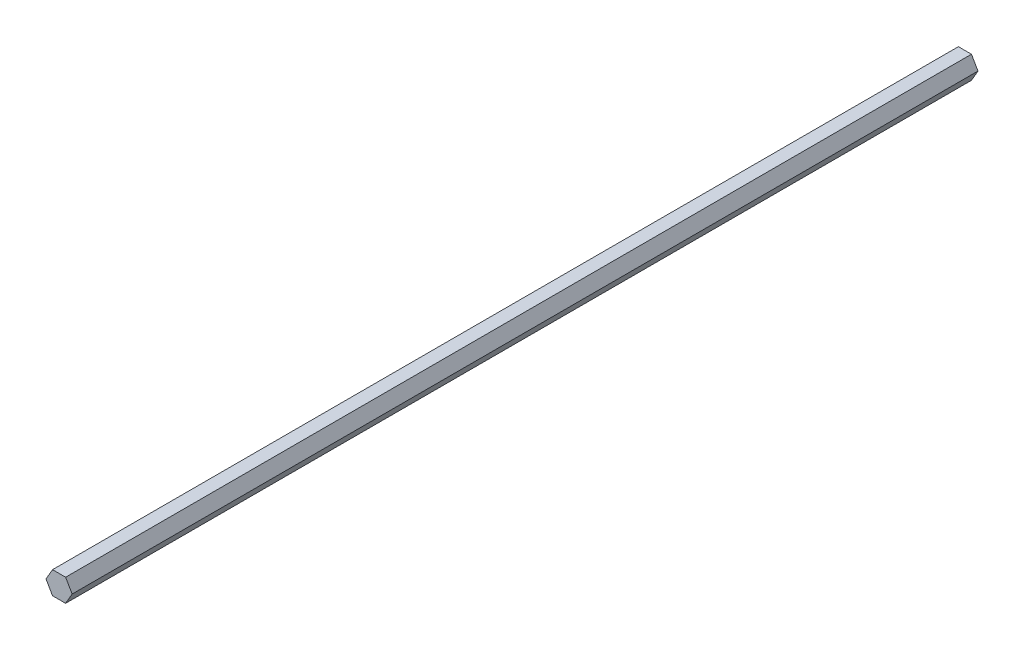
ISO-10303-21;
HEADER;
FILE_DESCRIPTION(('STEP AP214'),'2;1');
FILE_NAME('part.step','',(''),(''),'','','');
FILE_SCHEMA(('AUTOMOTIVE_DESIGN { 1 0 10303 214 1 1 1 1 }'));
ENDSEC;
DATA;
#1=APPLICATION_CONTEXT('core data for automotive mechanical design processes');
#2=APPLICATION_PROTOCOL_DEFINITION('international standard','automotive_design',2000,#1);
#3=PRODUCT_CONTEXT('',#1,'mechanical');
#4=PRODUCT('Part','Part','',(#3));
#5=PRODUCT_RELATED_PRODUCT_CATEGORY('part','',(#4));
#6=PRODUCT_DEFINITION_FORMATION('','',#4);
#7=PRODUCT_DEFINITION_CONTEXT('part definition',#1,'design');
#8=PRODUCT_DEFINITION('design','',#6,#7);
#9=PRODUCT_DEFINITION_SHAPE('','',#8);
#10=(LENGTH_UNIT() NAMED_UNIT(*) SI_UNIT(.MILLI.,.METRE.));
#11=(NAMED_UNIT(*) PLANE_ANGLE_UNIT() SI_UNIT($,.RADIAN.));
#12=(NAMED_UNIT(*) SI_UNIT($,.STERADIAN.) SOLID_ANGLE_UNIT());
#13=UNCERTAINTY_MEASURE_WITH_UNIT(LENGTH_MEASURE(1.E-05),#10,'distance_accuracy_value','');
#14=(GEOMETRIC_REPRESENTATION_CONTEXT(3) GLOBAL_UNCERTAINTY_ASSIGNED_CONTEXT((#13)) GLOBAL_UNIT_ASSIGNED_CONTEXT((#10,
#11,#12)) REPRESENTATION_CONTEXT('',''));
#15=CARTESIAN_POINT('',(0.,0.,0.));
#16=DIRECTION('',(0.,0.,1.));
#17=DIRECTION('',(1.,0.,0.));
#18=AXIS2_PLACEMENT_3D('',#15,#16,#17);
#19=CARTESIAN_POINT('',(3.6661742093542,-6.34999999999996,508.));
#20=DIRECTION('',(-0.866025403784441,0.499999999999995,0.));
#21=DIRECTION('',(-0.499999999999995,-0.866025403784441,0.));
#22=AXIS2_PLACEMENT_3D('',#19,#20,#21);
#23=PLANE('',#22);
#24=DIRECTION('',(0.499999999999995,0.866025403784441,0.));
#25=VECTOR('',#24,1.);
#26=CARTESIAN_POINT('',(3.6661742093542,-6.34999999999996,0.));
#27=LINE('',#26,#25);
#28=CARTESIAN_POINT('',(3.6661742093542,-6.34999999999996,0.));
#29=VERTEX_POINT('',#28);
#30=CARTESIAN_POINT('',(7.33234841870826,0.,0.));
#31=VERTEX_POINT('',#30);
#32=EDGE_CURVE('E121',#29,#31,#27,.T.);
#33=ORIENTED_EDGE('',*,*,#32,.T.);
#34=DIRECTION('',(0.,0.,-1.));
#35=VECTOR('',#34,1.);
#36=CARTESIAN_POINT('',(7.33234841870826,0.,508.));
#37=LINE('',#36,#35);
#38=CARTESIAN_POINT('',(7.33234841870826,0.,508.));
#39=VERTEX_POINT('',#38);
#40=EDGE_CURVE('E11',#39,#31,#37,.T.);
#41=ORIENTED_EDGE('',*,*,#40,.F.);
#42=DIRECTION('',(0.499999999999995,0.866025403784441,0.));
#43=VECTOR('',#42,1.);
#44=CARTESIAN_POINT('',(3.6661742093542,-6.34999999999996,508.));
#45=LINE('',#44,#43);
#46=CARTESIAN_POINT('',(3.6661742093542,-6.34999999999996,508.));
#47=VERTEX_POINT('',#46);
#48=EDGE_CURVE('E131',#47,#39,#45,.T.);
#49=ORIENTED_EDGE('',*,*,#48,.F.);
#50=DIRECTION('',(0.,0.,-1.));
#51=VECTOR('',#50,1.);
#52=CARTESIAN_POINT('',(3.6661742093542,-6.34999999999996,508.));
#53=LINE('',#52,#51);
#54=EDGE_CURVE('E117',#47,#29,#53,.T.);
#55=ORIENTED_EDGE('',*,*,#54,.T.);
#56=EDGE_LOOP('',(#33,#41,#49,#55));
#57=FACE_BOUND('',#56,.T.);
#58=ADVANCED_FACE('F37',(#57),#23,.F.);
#59=CARTESIAN_POINT('',(7.33234841870826,0.,508.));
#60=DIRECTION('',(-0.866025403784438,-0.500000000000001,0.));
#61=DIRECTION('',(0.500000000000001,-0.866025403784438,0.));
#62=AXIS2_PLACEMENT_3D('',#59,#60,#61);
#63=PLANE('',#62);
#64=DIRECTION('',(-0.500000000000001,0.866025403784438,0.));
#65=VECTOR('',#64,1.);
#66=CARTESIAN_POINT('',(7.33234841870826,0.,0.));
#67=LINE('',#66,#65);
#68=CARTESIAN_POINT('',(3.66617420935411,6.35000000000001,0.));
#69=VERTEX_POINT('',#68);
#70=EDGE_CURVE('E124',#31,#69,#67,.T.);
#71=ORIENTED_EDGE('',*,*,#70,.T.);
#72=DIRECTION('',(0.,0.,-1.));
#73=VECTOR('',#72,1.);
#74=CARTESIAN_POINT('',(3.66617420935411,6.35000000000001,508.));
#75=LINE('',#74,#73);
#76=CARTESIAN_POINT('',(3.66617420935411,6.35000000000001,508.));
#77=VERTEX_POINT('',#76);
#78=EDGE_CURVE('E45',#77,#69,#75,.T.);
#79=ORIENTED_EDGE('',*,*,#78,.F.);
#80=DIRECTION('',(-0.500000000000001,0.866025403784438,0.));
#81=VECTOR('',#80,1.);
#82=CARTESIAN_POINT('',(7.33234841870826,0.,508.));
#83=LINE('',#82,#81);
#84=EDGE_CURVE('E90',#39,#77,#83,.T.);
#85=ORIENTED_EDGE('',*,*,#84,.F.);
#86=ORIENTED_EDGE('',*,*,#40,.T.);
#87=EDGE_LOOP('',(#71,#79,#85,#86));
#88=FACE_BOUND('',#87,.T.);
#89=ADVANCED_FACE('F155',(#88),#63,.F.);
#90=CARTESIAN_POINT('',(3.66617420935411,6.35000000000001,508.));
#91=DIRECTION('',(0.,-1.,0.));
#92=DIRECTION('',(1.,0.,0.));
#93=AXIS2_PLACEMENT_3D('',#90,#91,#92);
#94=PLANE('',#93);
#95=DIRECTION('',(-1.,0.,0.));
#96=VECTOR('',#95,1.);
#97=CARTESIAN_POINT('',(3.66617420935411,6.35000000000001,0.));
#98=LINE('',#97,#96);
#99=CARTESIAN_POINT('',(-3.66617420935416,6.34999999999999,0.));
#100=VERTEX_POINT('',#99);
#101=EDGE_CURVE('E126',#69,#100,#98,.T.);
#102=ORIENTED_EDGE('',*,*,#101,.T.);
#103=DIRECTION('',(0.,0.,-1.));
#104=VECTOR('',#103,1.);
#105=CARTESIAN_POINT('',(-3.66617420935416,6.34999999999999,508.));
#106=LINE('',#105,#104);
#107=CARTESIAN_POINT('',(-3.66617420935416,6.34999999999999,508.));
#108=VERTEX_POINT('',#107);
#109=EDGE_CURVE('E112',#108,#100,#106,.T.);
#110=ORIENTED_EDGE('',*,*,#109,.F.);
#111=DIRECTION('',(-1.,0.,0.));
#112=VECTOR('',#111,1.);
#113=CARTESIAN_POINT('',(3.66617420935411,6.35000000000001,508.));
#114=LINE('',#113,#112);
#115=EDGE_CURVE('E103',#77,#108,#114,.T.);
#116=ORIENTED_EDGE('',*,*,#115,.F.);
#117=ORIENTED_EDGE('',*,*,#78,.T.);
#118=EDGE_LOOP('',(#102,#110,#116,#117));
#119=FACE_BOUND('',#118,.T.);
#120=ADVANCED_FACE('F137',(#119),#94,.F.);
#121=CARTESIAN_POINT('',(-3.66617420935416,6.34999999999999,508.));
#122=DIRECTION('',(0.866025403784442,-0.499999999999995,0.));
#123=DIRECTION('',(0.499999999999995,0.866025403784442,0.));
#124=AXIS2_PLACEMENT_3D('',#121,#122,#123);
#125=PLANE('',#124);
#126=DIRECTION('',(-0.499999999999995,-0.866025403784442,0.));
#127=VECTOR('',#126,1.);
#128=CARTESIAN_POINT('',(-3.66617420935416,6.34999999999999,0.));
#129=LINE('',#128,#127);
#130=CARTESIAN_POINT('',(-7.33234841870825,0.,0.));
#131=VERTEX_POINT('',#130);
#132=EDGE_CURVE('E111',#100,#131,#129,.T.);
#133=ORIENTED_EDGE('',*,*,#132,.T.);
#134=DIRECTION('',(0.,0.,-1.));
#135=VECTOR('',#134,1.);
#136=CARTESIAN_POINT('',(-7.33234841870825,0.,508.));
#137=LINE('',#136,#135);
#138=CARTESIAN_POINT('',(-7.33234841870825,0.,508.));
#139=VERTEX_POINT('',#138);
#140=EDGE_CURVE('E108',#139,#131,#137,.T.);
#141=ORIENTED_EDGE('',*,*,#140,.F.);
#142=DIRECTION('',(-0.499999999999995,-0.866025403784442,0.));
#143=VECTOR('',#142,1.);
#144=CARTESIAN_POINT('',(-3.66617420935416,6.34999999999999,508.));
#145=LINE('',#144,#143);
#146=EDGE_CURVE('E97',#108,#139,#145,.T.);
#147=ORIENTED_EDGE('',*,*,#146,.F.);
#148=ORIENTED_EDGE('',*,*,#109,.T.);
#149=EDGE_LOOP('',(#133,#141,#147,#148));
#150=FACE_BOUND('',#149,.T.);
#151=ADVANCED_FACE('F109',(#150),#125,.F.);
#152=CARTESIAN_POINT('',(-7.33234841870825,0.,508.));
#153=DIRECTION('',(0.866025403784434,0.500000000000007,0.));
#154=DIRECTION('',(-0.500000000000007,0.866025403784435,0.));
#155=AXIS2_PLACEMENT_3D('',#152,#153,#154);
#156=PLANE('',#155);
#157=DIRECTION('',(0.500000000000007,-0.866025403784434,0.));
#158=VECTOR('',#157,1.);
#159=CARTESIAN_POINT('',(-7.33234841870825,0.,0.));
#160=LINE('',#159,#158);
#161=CARTESIAN_POINT('',(-3.66617420935407,-6.35000000000004,0.));
#162=VERTEX_POINT('',#161);
#163=EDGE_CURVE('E76',#131,#162,#160,.T.);
#164=ORIENTED_EDGE('',*,*,#163,.T.);
#165=DIRECTION('',(0.,0.,-1.));
#166=VECTOR('',#165,1.);
#167=CARTESIAN_POINT('',(-3.66617420935407,-6.35000000000004,508.));
#168=LINE('',#167,#166);
#169=CARTESIAN_POINT('',(-3.66617420935407,-6.35000000000004,508.));
#170=VERTEX_POINT('',#169);
#171=EDGE_CURVE('E113',#170,#162,#168,.T.);
#172=ORIENTED_EDGE('',*,*,#171,.F.);
#173=DIRECTION('',(0.500000000000007,-0.866025403784434,0.));
#174=VECTOR('',#173,1.);
#175=CARTESIAN_POINT('',(-7.33234841870825,0.,508.));
#176=LINE('',#175,#174);
#177=EDGE_CURVE('E101',#139,#170,#176,.T.);
#178=ORIENTED_EDGE('',*,*,#177,.F.);
#179=ORIENTED_EDGE('',*,*,#140,.T.);
#180=EDGE_LOOP('',(#164,#172,#178,#179));
#181=FACE_BOUND('',#180,.T.);
#182=ADVANCED_FACE('F115',(#181),#156,.F.);
#183=CARTESIAN_POINT('',(-3.66617420935407,-6.35000000000004,508.));
#184=DIRECTION('',(0.,1.,0.));
#185=DIRECTION('',(-1.,0.,0.));
#186=AXIS2_PLACEMENT_3D('',#183,#184,#185);
#187=PLANE('',#186);
#188=DIRECTION('',(1.,0.,0.));
#189=VECTOR('',#188,1.);
#190=CARTESIAN_POINT('',(-3.66617420935407,-6.35000000000004,0.));
#191=LINE('',#190,#189);
#192=EDGE_CURVE('E82',#162,#29,#191,.T.);
#193=ORIENTED_EDGE('',*,*,#192,.T.);
#194=ORIENTED_EDGE('',*,*,#54,.F.);
#195=DIRECTION('',(1.,0.,0.));
#196=VECTOR('',#195,1.);
#197=CARTESIAN_POINT('',(-3.66617420935407,-6.35000000000004,508.));
#198=LINE('',#197,#196);
#199=EDGE_CURVE('E53',#170,#47,#198,.T.);
#200=ORIENTED_EDGE('',*,*,#199,.F.);
#201=ORIENTED_EDGE('',*,*,#171,.T.);
#202=EDGE_LOOP('',(#193,#194,#200,#201));
#203=FACE_BOUND('',#202,.T.);
#204=ADVANCED_FACE('F144',(#203),#187,.F.);
#205=CARTESIAN_POINT('',(0.,0.,508.));
#206=DIRECTION('',(0.,0.,1.));
#207=DIRECTION('',(1.,0.,0.));
#208=AXIS2_PLACEMENT_3D('',#205,#206,#207);
#209=PLANE('',#208);
#210=ORIENTED_EDGE('',*,*,#48,.T.);
#211=ORIENTED_EDGE('',*,*,#84,.T.);
#212=ORIENTED_EDGE('',*,*,#115,.T.);
#213=ORIENTED_EDGE('',*,*,#146,.T.);
#214=ORIENTED_EDGE('',*,*,#177,.T.);
#215=ORIENTED_EDGE('',*,*,#199,.T.);
#216=EDGE_LOOP('',(#210,#211,#212,#213,#214,#215));
#217=FACE_BOUND('',#216,.T.);
#218=ADVANCED_FACE('F99',(#217),#209,.T.);
#219=CARTESIAN_POINT('',(0.,0.,0.));
#220=DIRECTION('',(0.,0.,1.));
#221=DIRECTION('',(1.,0.,0.));
#222=AXIS2_PLACEMENT_3D('',#219,#220,#221);
#223=PLANE('',#222);
#224=ORIENTED_EDGE('',*,*,#32,.F.);
#225=ORIENTED_EDGE('',*,*,#192,.F.);
#226=ORIENTED_EDGE('',*,*,#163,.F.);
#227=ORIENTED_EDGE('',*,*,#132,.F.);
#228=ORIENTED_EDGE('',*,*,#101,.F.);
#229=ORIENTED_EDGE('',*,*,#70,.F.);
#230=EDGE_LOOP('',(#224,#225,#226,#227,#228,#229));
#231=FACE_BOUND('',#230,.T.);
#232=ADVANCED_FACE('F140',(#231),#223,.F.);
#233=CLOSED_SHELL('',(#58,#89,#120,#151,#182,#204,#218,#232));
#234=MANIFOLD_SOLID_BREP('B2',#233);
#235=ADVANCED_BREP_SHAPE_REPRESENTATION('',(#18,#234),#14);
#236=SHAPE_DEFINITION_REPRESENTATION(#9,#235);
ENDSEC;
END-ISO-10303-21;
